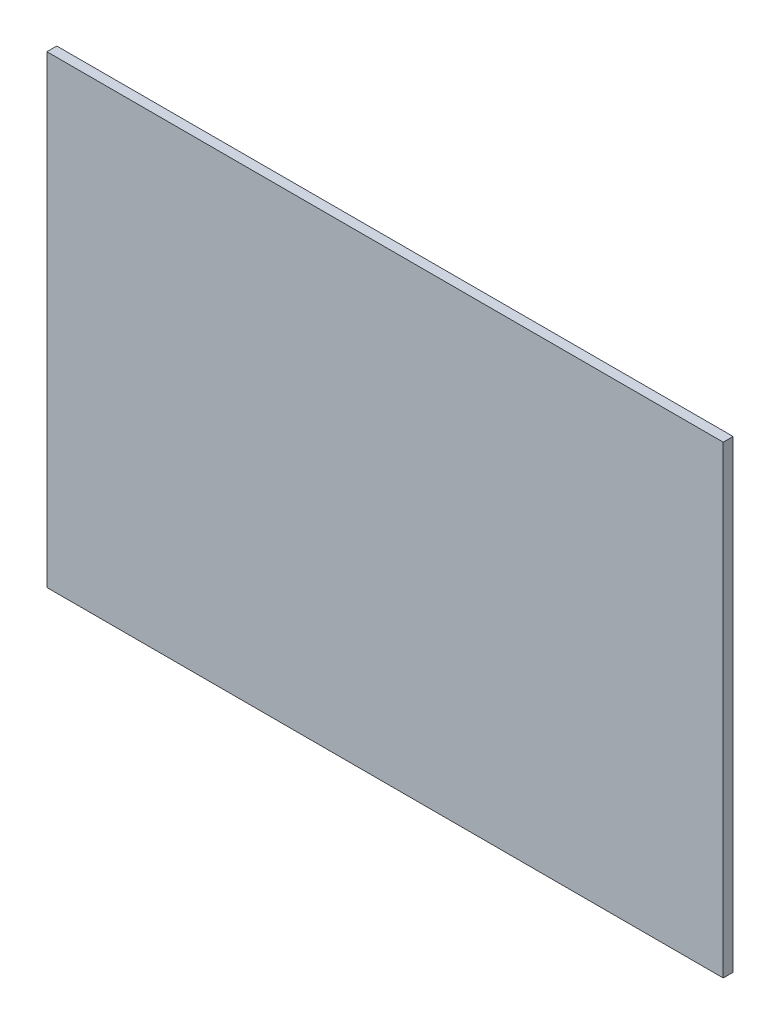
ISO-10303-21;
HEADER;
FILE_DESCRIPTION(('STEP AP214'),'2;1');
FILE_NAME('part.step','',(''),(''),'','','');
FILE_SCHEMA(('AUTOMOTIVE_DESIGN { 1 0 10303 214 1 1 1 1 }'));
ENDSEC;
DATA;
#1=APPLICATION_CONTEXT('core data for automotive mechanical design processes');
#2=APPLICATION_PROTOCOL_DEFINITION('international standard','automotive_design',2000,#1);
#3=PRODUCT_CONTEXT('',#1,'mechanical');
#4=PRODUCT('Part','Part','',(#3));
#5=PRODUCT_RELATED_PRODUCT_CATEGORY('part','',(#4));
#6=PRODUCT_DEFINITION_FORMATION('','',#4);
#7=PRODUCT_DEFINITION_CONTEXT('part definition',#1,'design');
#8=PRODUCT_DEFINITION('design','',#6,#7);
#9=PRODUCT_DEFINITION_SHAPE('','',#8);
#10=(LENGTH_UNIT() NAMED_UNIT(*) SI_UNIT(.MILLI.,.METRE.));
#11=(NAMED_UNIT(*) PLANE_ANGLE_UNIT() SI_UNIT($,.RADIAN.));
#12=(NAMED_UNIT(*) SI_UNIT($,.STERADIAN.) SOLID_ANGLE_UNIT());
#13=UNCERTAINTY_MEASURE_WITH_UNIT(LENGTH_MEASURE(1.E-05),#10,'distance_accuracy_value','');
#14=(GEOMETRIC_REPRESENTATION_CONTEXT(3) GLOBAL_UNCERTAINTY_ASSIGNED_CONTEXT((#13)) GLOBAL_UNIT_ASSIGNED_CONTEXT((#10,
#11,#12)) REPRESENTATION_CONTEXT('',''));
#15=CARTESIAN_POINT('',(0.,0.,0.));
#16=DIRECTION('',(0.,0.,1.));
#17=DIRECTION('',(1.,0.,0.));
#18=AXIS2_PLACEMENT_3D('',#15,#16,#17);
#19=CARTESIAN_POINT('',(-138.214285714286,104.196428571429,4.));
#20=DIRECTION('',(1.,0.,0.));
#21=DIRECTION('',(0.,1.,0.));
#22=AXIS2_PLACEMENT_3D('',#19,#20,#21);
#23=PLANE('',#22);
#24=DIRECTION('',(0.,-1.,0.));
#25=VECTOR('',#24,1.);
#26=CARTESIAN_POINT('',(-138.214285714286,104.196428571429,0.));
#27=LINE('',#26,#25);
#28=CARTESIAN_POINT('',(-138.214285714286,104.196428571429,0.));
#29=VERTEX_POINT('',#28);
#30=CARTESIAN_POINT('',(-138.214285714286,-83.8035714285714,0.));
#31=VERTEX_POINT('',#30);
#32=EDGE_CURVE('E107',#29,#31,#27,.T.);
#33=ORIENTED_EDGE('',*,*,#32,.T.);
#34=DIRECTION('',(0.,0.,-1.));
#35=VECTOR('',#34,1.);
#36=CARTESIAN_POINT('',(-138.214285714286,-83.8035714285714,4.));
#37=LINE('',#36,#35);
#38=CARTESIAN_POINT('',(-138.214285714286,-83.8035714285714,4.));
#39=VERTEX_POINT('',#38);
#40=EDGE_CURVE('E11',#39,#31,#37,.T.);
#41=ORIENTED_EDGE('',*,*,#40,.F.);
#42=DIRECTION('',(0.,-1.,0.));
#43=VECTOR('',#42,1.);
#44=CARTESIAN_POINT('',(-138.214285714286,104.196428571429,4.));
#45=LINE('',#44,#43);
#46=CARTESIAN_POINT('',(-138.214285714286,104.196428571429,4.));
#47=VERTEX_POINT('',#46);
#48=EDGE_CURVE('E91',#47,#39,#45,.T.);
#49=ORIENTED_EDGE('',*,*,#48,.F.);
#50=DIRECTION('',(0.,0.,-1.));
#51=VECTOR('',#50,1.);
#52=CARTESIAN_POINT('',(-138.214285714286,104.196428571429,4.));
#53=LINE('',#52,#51);
#54=EDGE_CURVE('E103',#47,#29,#53,.T.);
#55=ORIENTED_EDGE('',*,*,#54,.T.);
#56=EDGE_LOOP('',(#33,#41,#49,#55));
#57=FACE_BOUND('',#56,.T.);
#58=ADVANCED_FACE('F39',(#57),#23,.F.);
#59=CARTESIAN_POINT('',(-138.214285714286,-83.8035714285714,4.));
#60=DIRECTION('',(0.,1.,0.));
#61=DIRECTION('',(0.,0.,1.));
#62=AXIS2_PLACEMENT_3D('',#59,#60,#61);
#63=PLANE('',#62);
#64=DIRECTION('',(1.,0.,0.));
#65=VECTOR('',#64,1.);
#66=CARTESIAN_POINT('',(-138.214285714286,-83.8035714285714,0.));
#67=LINE('',#66,#65);
#68=CARTESIAN_POINT('',(135.785714285714,-83.8035714285714,0.));
#69=VERTEX_POINT('',#68);
#70=EDGE_CURVE('E96',#31,#69,#67,.T.);
#71=ORIENTED_EDGE('',*,*,#70,.T.);
#72=DIRECTION('',(0.,0.,-1.));
#73=VECTOR('',#72,1.);
#74=CARTESIAN_POINT('',(135.785714285714,-83.8035714285714,4.));
#75=LINE('',#74,#73);
#76=CARTESIAN_POINT('',(135.785714285714,-83.8035714285714,4.));
#77=VERTEX_POINT('',#76);
#78=EDGE_CURVE('E48',#77,#69,#75,.T.);
#79=ORIENTED_EDGE('',*,*,#78,.F.);
#80=DIRECTION('',(1.,0.,0.));
#81=VECTOR('',#80,1.);
#82=CARTESIAN_POINT('',(-138.214285714286,-83.8035714285714,4.));
#83=LINE('',#82,#81);
#84=EDGE_CURVE('E86',#39,#77,#83,.T.);
#85=ORIENTED_EDGE('',*,*,#84,.F.);
#86=ORIENTED_EDGE('',*,*,#40,.T.);
#87=EDGE_LOOP('',(#71,#79,#85,#86));
#88=FACE_BOUND('',#87,.T.);
#89=ADVANCED_FACE('F95',(#88),#63,.F.);
#90=CARTESIAN_POINT('',(135.785714285714,104.196428571429,4.));
#91=DIRECTION('',(-1.,0.,0.));
#92=DIRECTION('',(0.,0.,1.));
#93=AXIS2_PLACEMENT_3D('',#90,#91,#92);
#94=PLANE('',#93);
#95=DIRECTION('',(0.,1.,0.));
#96=VECTOR('',#95,1.);
#97=CARTESIAN_POINT('',(135.785714285714,104.196428571429,0.));
#98=LINE('',#97,#96);
#99=CARTESIAN_POINT('',(135.785714285714,104.196428571429,0.));
#100=VERTEX_POINT('',#99);
#101=EDGE_CURVE('E73',#69,#100,#98,.T.);
#102=ORIENTED_EDGE('',*,*,#101,.T.);
#103=DIRECTION('',(0.,0.,-1.));
#104=VECTOR('',#103,1.);
#105=CARTESIAN_POINT('',(135.785714285714,104.196428571429,4.));
#106=LINE('',#105,#104);
#107=CARTESIAN_POINT('',(135.785714285714,104.196428571429,4.));
#108=VERTEX_POINT('',#107);
#109=EDGE_CURVE('E98',#108,#100,#106,.T.);
#110=ORIENTED_EDGE('',*,*,#109,.F.);
#111=DIRECTION('',(0.,1.,0.));
#112=VECTOR('',#111,1.);
#113=CARTESIAN_POINT('',(135.785714285714,104.196428571429,4.));
#114=LINE('',#113,#112);
#115=EDGE_CURVE('E89',#77,#108,#114,.T.);
#116=ORIENTED_EDGE('',*,*,#115,.F.);
#117=ORIENTED_EDGE('',*,*,#78,.T.);
#118=EDGE_LOOP('',(#102,#110,#116,#117));
#119=FACE_BOUND('',#118,.T.);
#120=ADVANCED_FACE('F99',(#119),#94,.F.);
#121=CARTESIAN_POINT('',(-138.214285714286,104.196428571429,4.));
#122=DIRECTION('',(0.,-1.,0.));
#123=DIRECTION('',(0.,0.,-1.));
#124=AXIS2_PLACEMENT_3D('',#121,#122,#123);
#125=PLANE('',#124);
#126=DIRECTION('',(-1.,0.,0.));
#127=VECTOR('',#126,1.);
#128=CARTESIAN_POINT('',(-138.214285714286,104.196428571429,0.));
#129=LINE('',#128,#127);
#130=EDGE_CURVE('E79',#100,#29,#129,.T.);
#131=ORIENTED_EDGE('',*,*,#130,.T.);
#132=ORIENTED_EDGE('',*,*,#54,.F.);
#133=DIRECTION('',(-1.,0.,0.));
#134=VECTOR('',#133,1.);
#135=CARTESIAN_POINT('',(-138.214285714286,104.196428571429,4.));
#136=LINE('',#135,#134);
#137=EDGE_CURVE('E56',#108,#47,#136,.T.);
#138=ORIENTED_EDGE('',*,*,#137,.F.);
#139=ORIENTED_EDGE('',*,*,#109,.T.);
#140=EDGE_LOOP('',(#131,#132,#138,#139));
#141=FACE_BOUND('',#140,.T.);
#142=ADVANCED_FACE('F120',(#141),#125,.F.);
#143=CARTESIAN_POINT('',(0.,0.,4.));
#144=DIRECTION('',(0.,0.,1.));
#145=DIRECTION('',(1.,0.,0.));
#146=AXIS2_PLACEMENT_3D('',#143,#144,#145);
#147=PLANE('',#146);
#148=ORIENTED_EDGE('',*,*,#48,.T.);
#149=ORIENTED_EDGE('',*,*,#84,.T.);
#150=ORIENTED_EDGE('',*,*,#115,.T.);
#151=ORIENTED_EDGE('',*,*,#137,.T.);
#152=EDGE_LOOP('',(#148,#149,#150,#151));
#153=FACE_BOUND('',#152,.T.);
#154=ADVANCED_FACE('F87',(#153),#147,.T.);
#155=CARTESIAN_POINT('',(0.,0.,0.));
#156=DIRECTION('',(0.,0.,1.));
#157=DIRECTION('',(1.,0.,0.));
#158=AXIS2_PLACEMENT_3D('',#155,#156,#157);
#159=PLANE('',#158);
#160=ORIENTED_EDGE('',*,*,#32,.F.);
#161=ORIENTED_EDGE('',*,*,#130,.F.);
#162=ORIENTED_EDGE('',*,*,#101,.F.);
#163=ORIENTED_EDGE('',*,*,#70,.F.);
#164=EDGE_LOOP('',(#160,#161,#162,#163));
#165=FACE_BOUND('',#164,.T.);
#166=ADVANCED_FACE('F123',(#165),#159,.F.);
#167=CLOSED_SHELL('',(#58,#89,#120,#142,#154,#166));
#168=MANIFOLD_SOLID_BREP('B2',#167);
#169=ADVANCED_BREP_SHAPE_REPRESENTATION('',(#18,#168),#14);
#170=SHAPE_DEFINITION_REPRESENTATION(#9,#169);
ENDSEC;
END-ISO-10303-21;
